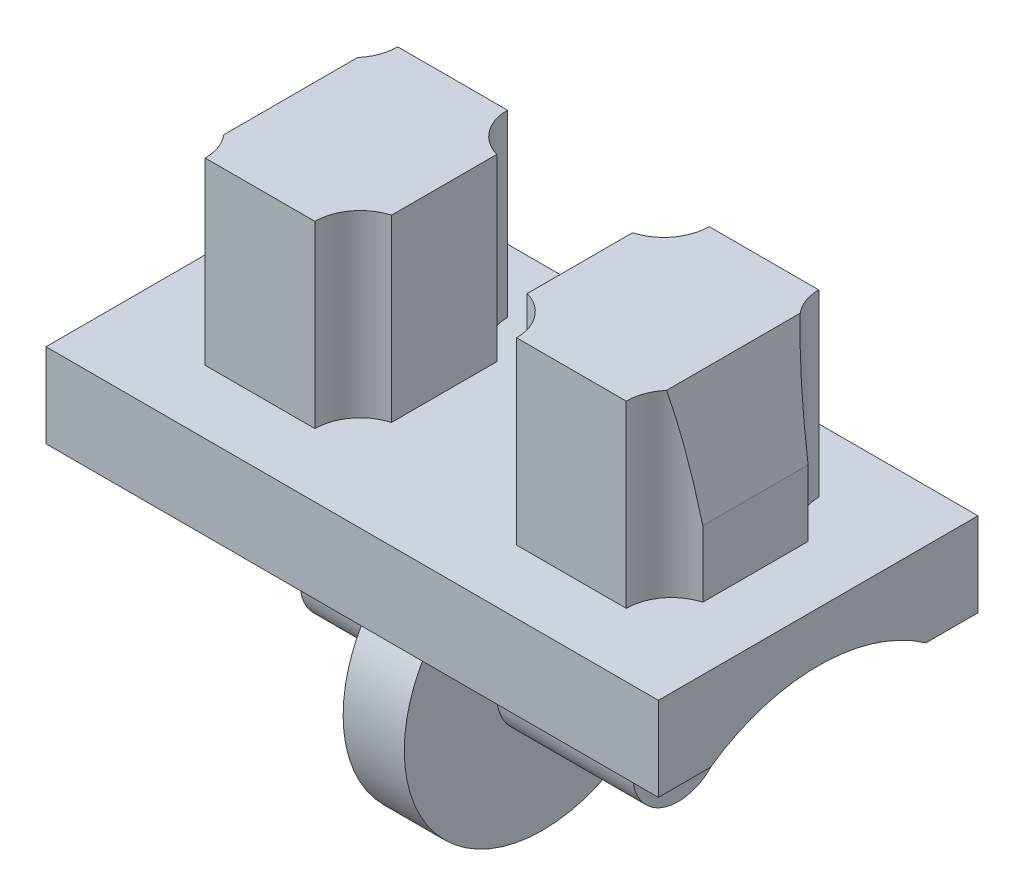
ISO-10303-21;
HEADER;
FILE_DESCRIPTION(('STEP AP214'),'2;1');
FILE_NAME('part.step','',(''),(''),'','','');
FILE_SCHEMA(('AUTOMOTIVE_DESIGN { 1 0 10303 214 1 1 1 1 }'));
ENDSEC;
DATA;
#1=APPLICATION_CONTEXT('core data for automotive mechanical design processes');
#2=APPLICATION_PROTOCOL_DEFINITION('international standard','automotive_design',2000,#1);
#3=PRODUCT_CONTEXT('',#1,'mechanical');
#4=PRODUCT('Part','Part','',(#3));
#5=PRODUCT_RELATED_PRODUCT_CATEGORY('part','',(#4));
#6=PRODUCT_DEFINITION_FORMATION('','',#4);
#7=PRODUCT_DEFINITION_CONTEXT('part definition',#1,'design');
#8=PRODUCT_DEFINITION('design','',#6,#7);
#9=PRODUCT_DEFINITION_SHAPE('','',#8);
#10=(LENGTH_UNIT() NAMED_UNIT(*) SI_UNIT(.MILLI.,.METRE.));
#11=(NAMED_UNIT(*) PLANE_ANGLE_UNIT() SI_UNIT($,.RADIAN.));
#12=(NAMED_UNIT(*) SI_UNIT($,.STERADIAN.) SOLID_ANGLE_UNIT());
#13=UNCERTAINTY_MEASURE_WITH_UNIT(LENGTH_MEASURE(1.E-05),#10,'distance_accuracy_value','');
#14=(GEOMETRIC_REPRESENTATION_CONTEXT(3) GLOBAL_UNCERTAINTY_ASSIGNED_CONTEXT((#13)) GLOBAL_UNIT_ASSIGNED_CONTEXT((#10,
#11,#12)) REPRESENTATION_CONTEXT('',''));
#15=CARTESIAN_POINT('',(0.,0.,0.));
#16=DIRECTION('',(0.,0.,1.));
#17=DIRECTION('',(1.,0.,0.));
#18=AXIS2_PLACEMENT_3D('',#15,#16,#17);
#19=CARTESIAN_POINT('',(4.215,0.,0.));
#20=DIRECTION('',(-1.,0.,0.));
#21=DIRECTION('',(0.,0.,1.));
#22=AXIS2_PLACEMENT_3D('',#19,#20,#21);
#23=CYLINDRICAL_SURFACE('',#22,1.155);
#24=CARTESIAN_POINT('',(0.775,0.,0.));
#25=DIRECTION('',(1.,0.,0.));
#26=DIRECTION('',(0.,0.,-1.));
#27=AXIS2_PLACEMENT_3D('',#24,#25,#26);
#28=CIRCLE('',#27,1.155);
#29=CARTESIAN_POINT('',(0.775,0.,-1.155));
#30=VERTEX_POINT('',#29);
#31=EDGE_CURVE('E447',#30,#30,#28,.T.);
#32=ORIENTED_EDGE('',*,*,#31,.T.);
#33=EDGE_LOOP('',(#32));
#34=FACE_BOUND('',#33,.T.);
#35=CARTESIAN_POINT('',(4.215,0.,0.));
#36=DIRECTION('',(1.,0.,0.));
#37=DIRECTION('',(0.,0.,-1.));
#38=AXIS2_PLACEMENT_3D('',#35,#36,#37);
#39=CIRCLE('',#38,1.155);
#40=CARTESIAN_POINT('',(4.215,0.,-1.155));
#41=VERTEX_POINT('',#40);
#42=EDGE_CURVE('E458',#41,#41,#39,.T.);
#43=ORIENTED_EDGE('',*,*,#42,.F.);
#44=EDGE_LOOP('',(#43));
#45=FACE_BOUND('',#44,.T.);
#46=ADVANCED_FACE('F43',(#34,#45),#23,.T.);
#47=CARTESIAN_POINT('',(4.215,0.,0.));
#48=DIRECTION('',(1.,0.,0.));
#49=DIRECTION('',(0.,0.,-1.));
#50=AXIS2_PLACEMENT_3D('',#47,#48,#49);
#51=PLANE('',#50);
#52=ORIENTED_EDGE('',*,*,#42,.T.);
#53=EDGE_LOOP('',(#52));
#54=FACE_BOUND('',#53,.T.);
#55=ADVANCED_FACE('F505',(#54),#51,.T.);
#56=CARTESIAN_POINT('',(0.775,0.,-2.73));
#57=DIRECTION('',(0.,0.,-1.));
#58=DIRECTION('',(0.,1.,0.));
#59=AXIS2_PLACEMENT_3D('',#56,#57,#58);
#60=PLANE('',#59);
#61=DIRECTION('',(-1.,0.,0.));
#62=VECTOR('',#61,1.);
#63=CARTESIAN_POINT('',(0.775,2.19820949866022,-2.73));
#64=LINE('',#63,#62);
#65=CARTESIAN_POINT('',(0.775,2.19820949866022,-2.73));
#66=VERTEX_POINT('',#65);
#67=CARTESIAN_POINT('',(-0.775,2.19820949866022,-2.73));
#68=VERTEX_POINT('',#67);
#69=EDGE_CURVE('E450',#66,#68,#64,.T.);
#70=ORIENTED_EDGE('',*,*,#69,.T.);
#71=DIRECTION('',(0.,-1.,0.));
#72=VECTOR('',#71,1.);
#73=CARTESIAN_POINT('',(-0.775,0.,-2.73));
#74=LINE('',#73,#72);
#75=CARTESIAN_POINT('',(-0.775,2.73710689330767,-2.73));
#76=VERTEX_POINT('',#75);
#77=EDGE_CURVE('E320',#76,#68,#74,.T.);
#78=ORIENTED_EDGE('',*,*,#77,.F.);
#79=DIRECTION('',(-1.,0.,0.));
#80=VECTOR('',#79,1.);
#81=CARTESIAN_POINT('',(0.775,2.73710689330767,-2.73));
#82=LINE('',#81,#80);
#83=CARTESIAN_POINT('',(0.775,2.73710689330767,-2.73));
#84=VERTEX_POINT('',#83);
#85=EDGE_CURVE('E456',#84,#76,#82,.T.);
#86=ORIENTED_EDGE('',*,*,#85,.F.);
#87=DIRECTION('',(0.,-1.,0.));
#88=VECTOR('',#87,1.);
#89=CARTESIAN_POINT('',(0.775,0.,-2.73));
#90=LINE('',#89,#88);
#91=EDGE_CURVE('E438',#84,#66,#90,.T.);
#92=ORIENTED_EDGE('',*,*,#91,.T.);
#93=EDGE_LOOP('',(#70,#78,#86,#92));
#94=FACE_BOUND('',#93,.T.);
#95=ADVANCED_FACE('F510',(#94),#60,.T.);
#96=CARTESIAN_POINT('',(0.775,0.,2.73));
#97=DIRECTION('',(0.,0.,-1.));
#98=DIRECTION('',(0.,1.,0.));
#99=AXIS2_PLACEMENT_3D('',#96,#97,#98);
#100=PLANE('',#99);
#101=DIRECTION('',(-1.,0.,0.));
#102=VECTOR('',#101,1.);
#103=CARTESIAN_POINT('',(0.775,2.73710689330767,2.73));
#104=LINE('',#103,#102);
#105=CARTESIAN_POINT('',(0.775,2.73710689330767,2.73));
#106=VERTEX_POINT('',#105);
#107=CARTESIAN_POINT('',(-0.775,2.73710689330767,2.73));
#108=VERTEX_POINT('',#107);
#109=EDGE_CURVE('E454',#106,#108,#104,.T.);
#110=ORIENTED_EDGE('',*,*,#109,.T.);
#111=DIRECTION('',(0.,-1.,0.));
#112=VECTOR('',#111,1.);
#113=CARTESIAN_POINT('',(-0.775,0.,2.73));
#114=LINE('',#113,#112);
#115=CARTESIAN_POINT('',(-0.775,2.19820949866022,2.73));
#116=VERTEX_POINT('',#115);
#117=EDGE_CURVE('E326',#108,#116,#114,.T.);
#118=ORIENTED_EDGE('',*,*,#117,.T.);
#119=DIRECTION('',(-1.,0.,0.));
#120=VECTOR('',#119,1.);
#121=CARTESIAN_POINT('',(0.775,2.19820949866022,2.73));
#122=LINE('',#121,#120);
#123=CARTESIAN_POINT('',(0.775,2.19820949866022,2.73));
#124=VERTEX_POINT('',#123);
#125=EDGE_CURVE('E452',#124,#116,#122,.T.);
#126=ORIENTED_EDGE('',*,*,#125,.F.);
#127=DIRECTION('',(0.,-1.,0.));
#128=VECTOR('',#127,1.);
#129=CARTESIAN_POINT('',(0.775,0.,2.73));
#130=LINE('',#129,#128);
#131=EDGE_CURVE('E443',#106,#124,#130,.T.);
#132=ORIENTED_EDGE('',*,*,#131,.F.);
#133=EDGE_LOOP('',(#110,#118,#126,#132));
#134=FACE_BOUND('',#133,.T.);
#135=ADVANCED_FACE('F517',(#134),#100,.F.);
#136=CARTESIAN_POINT('',(0.775,0.,0.));
#137=DIRECTION('',(-1.,0.,0.));
#138=DIRECTION('',(0.,0.,1.));
#139=AXIS2_PLACEMENT_3D('',#136,#137,#138);
#140=CYLINDRICAL_SURFACE('',#139,3.505);
#141=ORIENTED_EDGE('',*,*,#125,.T.);
#142=CARTESIAN_POINT('',(-0.775,0.,0.));
#143=DIRECTION('',(1.,0.,0.));
#144=DIRECTION('',(0.,0.,-1.));
#145=AXIS2_PLACEMENT_3D('',#142,#143,#144);
#146=CIRCLE('',#145,3.505);
#147=EDGE_CURVE('E329',#116,#68,#146,.T.);
#148=ORIENTED_EDGE('',*,*,#147,.T.);
#149=ORIENTED_EDGE('',*,*,#69,.F.);
#150=CARTESIAN_POINT('',(0.775,0.,0.));
#151=DIRECTION('',(1.,0.,0.));
#152=DIRECTION('',(0.,0.,-1.));
#153=AXIS2_PLACEMENT_3D('',#150,#151,#152);
#154=CIRCLE('',#153,3.505);
#155=EDGE_CURVE('E445',#124,#66,#154,.T.);
#156=ORIENTED_EDGE('',*,*,#155,.F.);
#157=EDGE_LOOP('',(#141,#148,#149,#156));
#158=FACE_BOUND('',#157,.T.);
#159=ADVANCED_FACE('F521',(#158),#140,.T.);
#160=CARTESIAN_POINT('',(0.775,0.,0.));
#161=DIRECTION('',(1.,0.,0.));
#162=DIRECTION('',(0.,0.,-1.));
#163=AXIS2_PLACEMENT_3D('',#160,#161,#162);
#164=PLANE('',#163);
#165=ORIENTED_EDGE('',*,*,#91,.F.);
#166=CARTESIAN_POINT('',(0.775,-1.15,0.));
#167=DIRECTION('',(1.,0.,0.));
#168=DIRECTION('',(0.,0.,-1.));
#169=AXIS2_PLACEMENT_3D('',#166,#167,#168);
#170=CIRCLE('',#169,4.75);
#171=EDGE_CURVE('E441',#106,#84,#170,.F.);
#172=ORIENTED_EDGE('',*,*,#171,.F.);
#173=ORIENTED_EDGE('',*,*,#131,.T.);
#174=ORIENTED_EDGE('',*,*,#155,.T.);
#175=EDGE_LOOP('',(#165,#172,#173,#174));
#176=FACE_BOUND('',#175,.T.);
#177=ORIENTED_EDGE('',*,*,#31,.F.);
#178=EDGE_LOOP('',(#177));
#179=FACE_BOUND('',#178,.T.);
#180=ADVANCED_FACE('F525',(#176,#179),#164,.T.);
#181=CARTESIAN_POINT('',(7.76,-1.15,0.));
#182=DIRECTION('',(-1.,0.,0.));
#183=DIRECTION('',(0.,0.,1.));
#184=AXIS2_PLACEMENT_3D('',#181,#182,#183);
#185=CYLINDRICAL_SURFACE('',#184,4.75);
#186=ORIENTED_EDGE('',*,*,#171,.T.);
#187=DIRECTION('',(-1.,0.,0.));
#188=VECTOR('',#187,1.);
#189=CARTESIAN_POINT('',(7.76,2.73710689330767,-2.73));
#190=LINE('',#189,#188);
#191=CARTESIAN_POINT('',(7.76,2.73710689330767,-2.73));
#192=VERTEX_POINT('',#191);
#193=EDGE_CURVE('E435',#192,#84,#190,.T.);
#194=ORIENTED_EDGE('',*,*,#193,.F.);
#195=CARTESIAN_POINT('',(7.76,-1.15,0.));
#196=DIRECTION('',(1.,0.,0.));
#197=DIRECTION('',(0.,0.,-1.));
#198=AXIS2_PLACEMENT_3D('',#195,#196,#197);
#199=CIRCLE('',#198,4.75);
#200=CARTESIAN_POINT('',(7.76,2.73710689330767,2.73));
#201=VERTEX_POINT('',#200);
#202=EDGE_CURVE('E409',#201,#192,#199,.F.);
#203=ORIENTED_EDGE('',*,*,#202,.F.);
#204=DIRECTION('',(-1.,0.,0.));
#205=VECTOR('',#204,1.);
#206=CARTESIAN_POINT('',(7.76,2.73710689330767,2.73));
#207=LINE('',#206,#205);
#208=EDGE_CURVE('E424',#201,#106,#207,.T.);
#209=ORIENTED_EDGE('',*,*,#208,.T.);
#210=EDGE_LOOP('',(#186,#194,#203,#209));
#211=FACE_BOUND('',#210,.T.);
#212=ADVANCED_FACE('F529',(#211),#185,.F.);
#213=CARTESIAN_POINT('',(7.76,2.73710689330767,0.));
#214=DIRECTION('',(0.,1.,0.));
#215=DIRECTION('',(0.,0.,1.));
#216=AXIS2_PLACEMENT_3D('',#213,#214,#215);
#217=PLANE('',#216);
#218=ORIENTED_EDGE('',*,*,#85,.T.);
#219=DIRECTION('',(1.,0.,0.));
#220=VECTOR('',#219,1.);
#221=CARTESIAN_POINT('',(-7.76,2.73710689330767,-2.73));
#222=LINE('',#221,#220);
#223=CARTESIAN_POINT('',(-7.76,2.73710689330767,-2.73));
#224=VERTEX_POINT('',#223);
#225=EDGE_CURVE('E317',#224,#76,#222,.T.);
#226=ORIENTED_EDGE('',*,*,#225,.F.);
#227=DIRECTION('',(0.,0.,-1.));
#228=VECTOR('',#227,1.);
#229=CARTESIAN_POINT('',(-7.76,2.73710689330767,0.));
#230=LINE('',#229,#228);
#231=CARTESIAN_POINT('',(-7.76,2.73710689330767,-4.05));
#232=VERTEX_POINT('',#231);
#233=EDGE_CURVE('E300',#224,#232,#230,.T.);
#234=ORIENTED_EDGE('',*,*,#233,.T.);
#235=DIRECTION('',(-1.,0.,0.));
#236=VECTOR('',#235,1.);
#237=CARTESIAN_POINT('',(7.76,2.73710689330767,-4.05));
#238=LINE('',#237,#236);
#239=CARTESIAN_POINT('',(7.76,2.73710689330767,-4.05));
#240=VERTEX_POINT('',#239);
#241=EDGE_CURVE('E433',#240,#232,#238,.T.);
#242=ORIENTED_EDGE('',*,*,#241,.F.);
#243=DIRECTION('',(0.,0.,-1.));
#244=VECTOR('',#243,1.);
#245=CARTESIAN_POINT('',(7.76,2.73710689330767,0.));
#246=LINE('',#245,#244);
#247=EDGE_CURVE('E412',#192,#240,#246,.T.);
#248=ORIENTED_EDGE('',*,*,#247,.F.);
#249=ORIENTED_EDGE('',*,*,#193,.T.);
#250=EDGE_LOOP('',(#218,#226,#234,#242,#248,#249));
#251=FACE_BOUND('',#250,.T.);
#252=ADVANCED_FACE('F533',(#251),#217,.F.);
#253=CARTESIAN_POINT('',(7.76,0.,-4.05));
#254=DIRECTION('',(0.,0.,1.));
#255=DIRECTION('',(1.,0.,0.));
#256=AXIS2_PLACEMENT_3D('',#253,#254,#255);
#257=PLANE('',#256);
#258=ORIENTED_EDGE('',*,*,#241,.T.);
#259=DIRECTION('',(0.,1.,0.));
#260=VECTOR('',#259,1.);
#261=CARTESIAN_POINT('',(-7.76,0.,-4.05));
#262=LINE('',#261,#260);
#263=CARTESIAN_POINT('',(-7.76,4.86710689330767,-4.05));
#264=VERTEX_POINT('',#263);
#265=EDGE_CURVE('E303',#232,#264,#262,.T.);
#266=ORIENTED_EDGE('',*,*,#265,.T.);
#267=DIRECTION('',(-1.,0.,0.));
#268=VECTOR('',#267,1.);
#269=CARTESIAN_POINT('',(7.76,4.86710689330767,-4.05));
#270=LINE('',#269,#268);
#271=CARTESIAN_POINT('',(7.76,4.86710689330767,-4.05));
#272=VERTEX_POINT('',#271);
#273=EDGE_CURVE('E431',#272,#264,#270,.T.);
#274=ORIENTED_EDGE('',*,*,#273,.F.);
#275=DIRECTION('',(0.,1.,0.));
#276=VECTOR('',#275,1.);
#277=CARTESIAN_POINT('',(7.76,0.,-4.05));
#278=LINE('',#277,#276);
#279=EDGE_CURVE('E414',#240,#272,#278,.T.);
#280=ORIENTED_EDGE('',*,*,#279,.F.);
#281=EDGE_LOOP('',(#258,#266,#274,#280));
#282=FACE_BOUND('',#281,.T.);
#283=ADVANCED_FACE('F537',(#282),#257,.F.);
#284=CARTESIAN_POINT('',(7.76,4.86710689330767,0.));
#285=DIRECTION('',(0.,1.,0.));
#286=DIRECTION('',(0.,0.,1.));
#287=AXIS2_PLACEMENT_3D('',#284,#285,#286);
#288=PLANE('',#287);
#289=CARTESIAN_POINT('',(1.405,4.86710689330767,-2.44));
#290=DIRECTION('',(0.,-1.,0.));
#291=DIRECTION('',(0.,0.,1.));
#292=AXIS2_PLACEMENT_3D('',#289,#290,#291);
#293=CIRCLE('',#292,1.15);
#294=CARTESIAN_POINT('',(2.555,4.86710689330767,-2.44));
#295=VERTEX_POINT('',#294);
#296=CARTESIAN_POINT('',(1.72,4.86710689330767,-1.33398236903746));
#297=VERTEX_POINT('',#296);
#298=EDGE_CURVE('E347',#295,#297,#293,.T.);
#299=ORIENTED_EDGE('',*,*,#298,.F.);
#300=DIRECTION('',(-1.,0.,0.));
#301=VECTOR('',#300,1.);
#302=CARTESIAN_POINT('',(2.555,4.86710689330767,-2.44));
#303=LINE('',#302,#301);
#304=CARTESIAN_POINT('',(5.335,4.86710689330767,-2.44));
#305=VERTEX_POINT('',#304);
#306=EDGE_CURVE('E352',#305,#295,#303,.T.);
#307=ORIENTED_EDGE('',*,*,#306,.F.);
#308=CARTESIAN_POINT('',(6.485,4.86710689330767,-2.44));
#309=DIRECTION('',(0.,-1.,0.));
#310=DIRECTION('',(0.,0.,-1.));
#311=AXIS2_PLACEMENT_3D('',#308,#309,#310);
#312=CIRCLE('',#311,1.15);
#313=CARTESIAN_POINT('',(6.17,4.86710689330767,-1.33398236903746));
#314=VERTEX_POINT('',#313);
#315=EDGE_CURVE('E383',#314,#305,#312,.T.);
#316=ORIENTED_EDGE('',*,*,#315,.F.);
#317=DIRECTION('',(0.,0.,-1.));
#318=VECTOR('',#317,1.);
#319=CARTESIAN_POINT('',(6.17,4.86710689330767,-1.33398236903746));
#320=LINE('',#319,#318);
#321=CARTESIAN_POINT('',(6.17,4.86710689330767,1.33398236903746));
#322=VERTEX_POINT('',#321);
#323=EDGE_CURVE('E380',#322,#314,#320,.T.);
#324=ORIENTED_EDGE('',*,*,#323,.F.);
#325=CARTESIAN_POINT('',(6.485,4.86710689330767,2.44));
#326=DIRECTION('',(0.,-1.,0.));
#327=DIRECTION('',(0.,0.,1.));
#328=AXIS2_PLACEMENT_3D('',#325,#326,#327);
#329=CIRCLE('',#328,1.15);
#330=CARTESIAN_POINT('',(5.335,4.86710689330767,2.44));
#331=VERTEX_POINT('',#330);
#332=EDGE_CURVE('E377',#331,#322,#329,.T.);
#333=ORIENTED_EDGE('',*,*,#332,.F.);
#334=DIRECTION('',(1.,0.,0.));
#335=VECTOR('',#334,1.);
#336=CARTESIAN_POINT('',(2.555,4.86710689330767,2.44));
#337=LINE('',#336,#335);
#338=CARTESIAN_POINT('',(2.555,4.86710689330767,2.44));
#339=VERTEX_POINT('',#338);
#340=EDGE_CURVE('E374',#339,#331,#337,.T.);
#341=ORIENTED_EDGE('',*,*,#340,.F.);
#342=CARTESIAN_POINT('',(1.405,4.86710689330767,2.44));
#343=DIRECTION('',(0.,-1.,0.));
#344=DIRECTION('',(0.,0.,-1.));
#345=AXIS2_PLACEMENT_3D('',#342,#343,#344);
#346=CIRCLE('',#345,1.15);
#347=CARTESIAN_POINT('',(1.72,4.86710689330767,1.33398236903746));
#348=VERTEX_POINT('',#347);
#349=EDGE_CURVE('E371',#348,#339,#346,.T.);
#350=ORIENTED_EDGE('',*,*,#349,.F.);
#351=DIRECTION('',(0.,0.,1.));
#352=VECTOR('',#351,1.);
#353=CARTESIAN_POINT('',(1.72,4.86710689330767,1.33398236903746));
#354=LINE('',#353,#352);
#355=EDGE_CURVE('E368',#297,#348,#354,.T.);
#356=ORIENTED_EDGE('',*,*,#355,.F.);
#357=EDGE_LOOP('',(#299,#307,#316,#324,#333,#341,#350,#356));
#358=FACE_BOUND('',#357,.T.);
#359=ORIENTED_EDGE('',*,*,#273,.T.);
#360=DIRECTION('',(0.,0.,-1.));
#361=VECTOR('',#360,1.);
#362=CARTESIAN_POINT('',(-7.76,4.86710689330767,0.));
#363=LINE('',#362,#361);
#364=CARTESIAN_POINT('',(-7.76,4.86710689330767,4.05));
#365=VERTEX_POINT('',#364);
#366=EDGE_CURVE('E306',#365,#264,#363,.T.);
#367=ORIENTED_EDGE('',*,*,#366,.F.);
#368=DIRECTION('',(-1.,0.,0.));
#369=VECTOR('',#368,1.);
#370=CARTESIAN_POINT('',(7.76,4.86710689330767,4.05));
#371=LINE('',#370,#369);
#372=CARTESIAN_POINT('',(7.76,4.86710689330767,4.05));
#373=VERTEX_POINT('',#372);
#374=EDGE_CURVE('E429',#373,#365,#371,.T.);
#375=ORIENTED_EDGE('',*,*,#374,.F.);
#376=DIRECTION('',(0.,0.,-1.));
#377=VECTOR('',#376,1.);
#378=CARTESIAN_POINT('',(7.76,4.86710689330767,0.));
#379=LINE('',#378,#377);
#380=EDGE_CURVE('E416',#373,#272,#379,.T.);
#381=ORIENTED_EDGE('',*,*,#380,.T.);
#382=EDGE_LOOP('',(#359,#367,#375,#381));
#383=FACE_BOUND('',#382,.T.);
#384=CARTESIAN_POINT('',(-1.405,4.86710689330767,-2.44));
#385=DIRECTION('',(0.,1.,0.));
#386=DIRECTION('',(0.,0.,1.));
#387=AXIS2_PLACEMENT_3D('',#384,#385,#386);
#388=CIRCLE('',#387,1.15);
#389=CARTESIAN_POINT('',(-2.555,4.86710689330767,-2.44));
#390=VERTEX_POINT('',#389);
#391=CARTESIAN_POINT('',(-1.72,4.86710689330767,-1.33398236903746));
#392=VERTEX_POINT('',#391);
#393=EDGE_CURVE('E269',#390,#392,#388,.T.);
#394=ORIENTED_EDGE('',*,*,#393,.T.);
#395=DIRECTION('',(0.,0.,1.));
#396=VECTOR('',#395,1.);
#397=CARTESIAN_POINT('',(-1.72,4.86710689330767,1.33398236903746));
#398=LINE('',#397,#396);
#399=CARTESIAN_POINT('',(-1.72,4.86710689330767,1.33398236903746));
#400=VERTEX_POINT('',#399);
#401=EDGE_CURVE('E242',#392,#400,#398,.T.);
#402=ORIENTED_EDGE('',*,*,#401,.T.);
#403=CARTESIAN_POINT('',(-1.405,4.86710689330767,2.44));
#404=DIRECTION('',(0.,1.,0.));
#405=DIRECTION('',(0.,0.,-1.));
#406=AXIS2_PLACEMENT_3D('',#403,#404,#405);
#407=CIRCLE('',#406,1.15);
#408=CARTESIAN_POINT('',(-2.555,4.86710689330767,2.44));
#409=VERTEX_POINT('',#408);
#410=EDGE_CURVE('E272',#400,#409,#407,.T.);
#411=ORIENTED_EDGE('',*,*,#410,.T.);
#412=DIRECTION('',(-1.,0.,0.));
#413=VECTOR('',#412,1.);
#414=CARTESIAN_POINT('',(-2.555,4.86710689330767,2.44));
#415=LINE('',#414,#413);
#416=CARTESIAN_POINT('',(-5.335,4.86710689330767,2.44));
#417=VERTEX_POINT('',#416);
#418=EDGE_CURVE('E275',#409,#417,#415,.T.);
#419=ORIENTED_EDGE('',*,*,#418,.T.);
#420=CARTESIAN_POINT('',(-6.485,4.86710689330767,2.44));
#421=DIRECTION('',(0.,1.,0.));
#422=DIRECTION('',(0.,0.,1.));
#423=AXIS2_PLACEMENT_3D('',#420,#421,#422);
#424=CIRCLE('',#423,1.15);
#425=CARTESIAN_POINT('',(-6.17,4.86710689330767,1.33398236903746));
#426=VERTEX_POINT('',#425);
#427=EDGE_CURVE('E278',#417,#426,#424,.T.);
#428=ORIENTED_EDGE('',*,*,#427,.T.);
#429=DIRECTION('',(0.,0.,-1.));
#430=VECTOR('',#429,1.);
#431=CARTESIAN_POINT('',(-6.17,4.86710689330767,-1.33398236903746));
#432=LINE('',#431,#430);
#433=CARTESIAN_POINT('',(-6.17,4.86710689330767,-1.33398236903746));
#434=VERTEX_POINT('',#433);
#435=EDGE_CURVE('E281',#426,#434,#432,.T.);
#436=ORIENTED_EDGE('',*,*,#435,.T.);
#437=CARTESIAN_POINT('',(-6.485,4.86710689330767,-2.44));
#438=DIRECTION('',(0.,1.,0.));
#439=DIRECTION('',(0.,0.,-1.));
#440=AXIS2_PLACEMENT_3D('',#437,#438,#439);
#441=CIRCLE('',#440,1.15);
#442=CARTESIAN_POINT('',(-5.335,4.86710689330767,-2.44));
#443=VERTEX_POINT('',#442);
#444=EDGE_CURVE('E254',#434,#443,#441,.T.);
#445=ORIENTED_EDGE('',*,*,#444,.T.);
#446=DIRECTION('',(1.,0.,0.));
#447=VECTOR('',#446,1.);
#448=CARTESIAN_POINT('',(-2.555,4.86710689330767,-2.44));
#449=LINE('',#448,#447);
#450=EDGE_CURVE('E251',#443,#390,#449,.T.);
#451=ORIENTED_EDGE('',*,*,#450,.T.);
#452=EDGE_LOOP('',(#394,#402,#411,#419,#428,#436,#445,#451));
#453=FACE_BOUND('',#452,.T.);
#454=ADVANCED_FACE('F541',(#358,#383,#453),#288,.T.);
#455=CARTESIAN_POINT('',(7.76,0.,4.05));
#456=DIRECTION('',(0.,0.,1.));
#457=DIRECTION('',(1.,0.,0.));
#458=AXIS2_PLACEMENT_3D('',#455,#456,#457);
#459=PLANE('',#458);
#460=ORIENTED_EDGE('',*,*,#374,.T.);
#461=DIRECTION('',(0.,1.,0.));
#462=VECTOR('',#461,1.);
#463=CARTESIAN_POINT('',(-7.76,0.,4.05));
#464=LINE('',#463,#462);
#465=CARTESIAN_POINT('',(-7.76,2.73710689330767,4.05));
#466=VERTEX_POINT('',#465);
#467=EDGE_CURVE('E309',#466,#365,#464,.T.);
#468=ORIENTED_EDGE('',*,*,#467,.F.);
#469=DIRECTION('',(-1.,0.,0.));
#470=VECTOR('',#469,1.);
#471=CARTESIAN_POINT('',(7.76,2.73710689330767,4.05));
#472=LINE('',#471,#470);
#473=CARTESIAN_POINT('',(7.76,2.73710689330767,4.05));
#474=VERTEX_POINT('',#473);
#475=EDGE_CURVE('E427',#474,#466,#472,.T.);
#476=ORIENTED_EDGE('',*,*,#475,.F.);
#477=DIRECTION('',(0.,1.,0.));
#478=VECTOR('',#477,1.);
#479=CARTESIAN_POINT('',(7.76,0.,4.05));
#480=LINE('',#479,#478);
#481=EDGE_CURVE('E419',#474,#373,#480,.T.);
#482=ORIENTED_EDGE('',*,*,#481,.T.);
#483=EDGE_LOOP('',(#460,#468,#476,#482));
#484=FACE_BOUND('',#483,.T.);
#485=ADVANCED_FACE('F545',(#484),#459,.T.);
#486=CARTESIAN_POINT('',(7.76,2.73710689330767,0.));
#487=DIRECTION('',(0.,1.,0.));
#488=DIRECTION('',(0.,0.,1.));
#489=AXIS2_PLACEMENT_3D('',#486,#487,#488);
#490=PLANE('',#489);
#491=ORIENTED_EDGE('',*,*,#475,.T.);
#492=DIRECTION('',(0.,0.,-1.));
#493=VECTOR('',#492,1.);
#494=CARTESIAN_POINT('',(-7.76,2.73710689330767,0.));
#495=LINE('',#494,#493);
#496=CARTESIAN_POINT('',(-7.76,2.73710689330767,2.73));
#497=VERTEX_POINT('',#496);
#498=EDGE_CURVE('E312',#466,#497,#495,.T.);
#499=ORIENTED_EDGE('',*,*,#498,.T.);
#500=DIRECTION('',(1.,0.,0.));
#501=VECTOR('',#500,1.);
#502=CARTESIAN_POINT('',(-7.76,2.73710689330767,2.73));
#503=LINE('',#502,#501);
#504=EDGE_CURVE('E314',#497,#108,#503,.T.);
#505=ORIENTED_EDGE('',*,*,#504,.T.);
#506=ORIENTED_EDGE('',*,*,#109,.F.);
#507=ORIENTED_EDGE('',*,*,#208,.F.);
#508=DIRECTION('',(0.,0.,-1.));
#509=VECTOR('',#508,1.);
#510=CARTESIAN_POINT('',(7.76,2.73710689330767,0.));
#511=LINE('',#510,#509);
#512=EDGE_CURVE('E422',#474,#201,#511,.T.);
#513=ORIENTED_EDGE('',*,*,#512,.F.);
#514=EDGE_LOOP('',(#491,#499,#505,#506,#507,#513));
#515=FACE_BOUND('',#514,.T.);
#516=ADVANCED_FACE('F549',(#515),#490,.F.);
#517=CARTESIAN_POINT('',(7.76,0.,0.));
#518=DIRECTION('',(1.,0.,0.));
#519=DIRECTION('',(0.,0.,-1.));
#520=AXIS2_PLACEMENT_3D('',#517,#518,#519);
#521=PLANE('',#520);
#522=ORIENTED_EDGE('',*,*,#202,.T.);
#523=ORIENTED_EDGE('',*,*,#247,.T.);
#524=ORIENTED_EDGE('',*,*,#279,.T.);
#525=ORIENTED_EDGE('',*,*,#380,.F.);
#526=ORIENTED_EDGE('',*,*,#481,.F.);
#527=ORIENTED_EDGE('',*,*,#512,.T.);
#528=EDGE_LOOP('',(#522,#523,#524,#525,#526,#527));
#529=FACE_BOUND('',#528,.T.);
#530=ADVANCED_FACE('F553',(#529),#521,.T.);
#531=CARTESIAN_POINT('',(1.405,9.41710689330767,-2.44));
#532=DIRECTION('',(0.,-1.,0.));
#533=DIRECTION('',(0.,0.,-1.));
#534=AXIS2_PLACEMENT_3D('',#531,#532,#533);
#535=CYLINDRICAL_SURFACE('',#534,1.15);
#536=ORIENTED_EDGE('',*,*,#298,.T.);
#537=DIRECTION('',(0.,-1.,0.));
#538=VECTOR('',#537,1.);
#539=CARTESIAN_POINT('',(1.72,9.41710689330767,-1.33398236903746));
#540=LINE('',#539,#538);
#541=CARTESIAN_POINT('',(1.72,9.41710689330767,-1.33398236903746));
#542=VERTEX_POINT('',#541);
#543=EDGE_CURVE('E406',#542,#297,#540,.T.);
#544=ORIENTED_EDGE('',*,*,#543,.F.);
#545=CARTESIAN_POINT('',(1.405,9.41710689330767,-2.44));
#546=DIRECTION('',(0.,-1.,0.));
#547=DIRECTION('',(0.,0.,1.));
#548=AXIS2_PLACEMENT_3D('',#545,#546,#547);
#549=CIRCLE('',#548,1.15);
#550=CARTESIAN_POINT('',(2.555,9.41710689330767,-2.44));
#551=VERTEX_POINT('',#550);
#552=EDGE_CURVE('E348',#551,#542,#549,.T.);
#553=ORIENTED_EDGE('',*,*,#552,.F.);
#554=DIRECTION('',(0.,-1.,0.));
#555=VECTOR('',#554,1.);
#556=CARTESIAN_POINT('',(2.555,9.41710689330767,-2.44));
#557=LINE('',#556,#555);
#558=EDGE_CURVE('E365',#551,#295,#557,.T.);
#559=ORIENTED_EDGE('',*,*,#558,.T.);
#560=EDGE_LOOP('',(#536,#544,#553,#559));
#561=FACE_BOUND('',#560,.T.);
#562=ADVANCED_FACE('F481',(#561),#535,.F.);
#563=CARTESIAN_POINT('',(1.72,9.41710689330767,1.33398236903746));
#564=DIRECTION('',(1.,0.,0.));
#565=DIRECTION('',(0.,0.,-1.));
#566=AXIS2_PLACEMENT_3D('',#563,#564,#565);
#567=PLANE('',#566);
#568=ORIENTED_EDGE('',*,*,#355,.T.);
#569=DIRECTION('',(0.,-1.,0.));
#570=VECTOR('',#569,1.);
#571=CARTESIAN_POINT('',(1.72,9.41710689330767,1.33398236903746));
#572=LINE('',#571,#570);
#573=CARTESIAN_POINT('',(1.72,9.41710689330767,1.33398236903746));
#574=VERTEX_POINT('',#573);
#575=EDGE_CURVE('E403',#574,#348,#572,.T.);
#576=ORIENTED_EDGE('',*,*,#575,.F.);
#577=DIRECTION('',(0.,0.,1.));
#578=VECTOR('',#577,1.);
#579=CARTESIAN_POINT('',(1.72,9.41710689330767,1.33398236903746));
#580=LINE('',#579,#578);
#581=EDGE_CURVE('E351',#542,#574,#580,.T.);
#582=ORIENTED_EDGE('',*,*,#581,.F.);
#583=ORIENTED_EDGE('',*,*,#543,.T.);
#584=EDGE_LOOP('',(#568,#576,#582,#583));
#585=FACE_BOUND('',#584,.T.);
#586=ADVANCED_FACE('F483',(#585),#567,.F.);
#587=CARTESIAN_POINT('',(1.405,9.41710689330767,2.44));
#588=DIRECTION('',(0.,-1.,0.));
#589=DIRECTION('',(0.,0.,-1.));
#590=AXIS2_PLACEMENT_3D('',#587,#588,#589);
#591=CYLINDRICAL_SURFACE('',#590,1.15);
#592=ORIENTED_EDGE('',*,*,#349,.T.);
#593=DIRECTION('',(0.,-1.,0.));
#594=VECTOR('',#593,1.);
#595=CARTESIAN_POINT('',(2.555,9.41710689330767,2.44));
#596=LINE('',#595,#594);
#597=CARTESIAN_POINT('',(2.555,9.41710689330767,2.44));
#598=VERTEX_POINT('',#597);
#599=EDGE_CURVE('E400',#598,#339,#596,.T.);
#600=ORIENTED_EDGE('',*,*,#599,.F.);
#601=CARTESIAN_POINT('',(1.405,9.41710689330767,2.44));
#602=DIRECTION('',(0.,-1.,0.));
#603=DIRECTION('',(0.,0.,-1.));
#604=AXIS2_PLACEMENT_3D('',#601,#602,#603);
#605=CIRCLE('',#604,1.15);
#606=EDGE_CURVE('E354',#574,#598,#605,.T.);
#607=ORIENTED_EDGE('',*,*,#606,.F.);
#608=ORIENTED_EDGE('',*,*,#575,.T.);
#609=EDGE_LOOP('',(#592,#600,#607,#608));
#610=FACE_BOUND('',#609,.T.);
#611=ADVANCED_FACE('F487',(#610),#591,.F.);
#612=CARTESIAN_POINT('',(2.555,9.41710689330767,2.44));
#613=DIRECTION('',(0.,0.,-1.));
#614=DIRECTION('',(-1.,0.,0.));
#615=AXIS2_PLACEMENT_3D('',#612,#613,#614);
#616=PLANE('',#615);
#617=ORIENTED_EDGE('',*,*,#340,.T.);
#618=DIRECTION('',(0.,-1.,0.));
#619=VECTOR('',#618,1.);
#620=CARTESIAN_POINT('',(5.335,9.41710689330767,2.44));
#621=LINE('',#620,#619);
#622=CARTESIAN_POINT('',(5.335,9.41710689330767,2.44));
#623=VERTEX_POINT('',#622);
#624=EDGE_CURVE('E397',#623,#331,#621,.T.);
#625=ORIENTED_EDGE('',*,*,#624,.F.);
#626=DIRECTION('',(1.,0.,0.));
#627=VECTOR('',#626,1.);
#628=CARTESIAN_POINT('',(2.555,9.41710689330767,2.44));
#629=LINE('',#628,#627);
#630=EDGE_CURVE('E356',#598,#623,#629,.T.);
#631=ORIENTED_EDGE('',*,*,#630,.F.);
#632=ORIENTED_EDGE('',*,*,#599,.T.);
#633=EDGE_LOOP('',(#617,#625,#631,#632));
#634=FACE_BOUND('',#633,.T.);
#635=ADVANCED_FACE('F491',(#634),#616,.F.);
#636=CARTESIAN_POINT('',(6.485,9.41710689330767,2.44));
#637=DIRECTION('',(0.,-1.,0.));
#638=DIRECTION('',(0.,0.,-1.));
#639=AXIS2_PLACEMENT_3D('',#636,#637,#638);
#640=CYLINDRICAL_SURFACE('',#639,1.15);
#641=DIRECTION('',(0.,-1.,0.));
#642=VECTOR('',#641,1.);
#643=CARTESIAN_POINT('',(6.17,9.41710689330767,1.33398236903746));
#644=LINE('',#643,#642);
#645=CARTESIAN_POINT('',(6.17,6.54710689330762,1.33398236903746));
#646=VERTEX_POINT('',#645);
#647=EDGE_CURVE('E395',#646,#322,#644,.T.);
#648=ORIENTED_EDGE('',*,*,#647,.F.);
#649=CARTESIAN_POINT('',(6.485,4.93273189330758,2.44));
#650=DIRECTION('',(0.9814905920257,0.191510359419645,0.));
#651=DIRECTION('',(0.191510359419645,-0.9814905920257,0.));
#652=AXIS2_PLACEMENT_3D('',#649,#650,#651);
#653=ELLIPSE('',#652,6.00489709008417,1.15);
#654=CARTESIAN_POINT('',(5.61,9.41710689330767,1.69375942217004));
#655=VERTEX_POINT('',#654);
#656=EDGE_CURVE('E11',#646,#655,#653,.T.);
#657=ORIENTED_EDGE('',*,*,#656,.T.);
#658=CARTESIAN_POINT('',(6.485,9.41710689330767,2.44));
#659=DIRECTION('',(0.,-1.,0.));
#660=DIRECTION('',(0.,0.,1.));
#661=AXIS2_PLACEMENT_3D('',#658,#659,#660);
#662=CIRCLE('',#661,1.15);
#663=EDGE_CURVE('E358',#623,#655,#662,.T.);
#664=ORIENTED_EDGE('',*,*,#663,.F.);
#665=ORIENTED_EDGE('',*,*,#624,.T.);
#666=ORIENTED_EDGE('',*,*,#332,.T.);
#667=EDGE_LOOP('',(#648,#657,#664,#665,#666));
#668=FACE_BOUND('',#667,.T.);
#669=ADVANCED_FACE('F493',(#668),#640,.F.);
#670=CARTESIAN_POINT('',(6.17,9.41710689330767,-1.33398236903746));
#671=DIRECTION('',(-1.,0.,0.));
#672=DIRECTION('',(0.,0.,1.));
#673=AXIS2_PLACEMENT_3D('',#670,#671,#672);
#674=PLANE('',#673);
#675=DIRECTION('',(0.,-1.,0.));
#676=VECTOR('',#675,1.);
#677=CARTESIAN_POINT('',(6.17,9.41710689330767,-1.33398236903746));
#678=LINE('',#677,#676);
#679=CARTESIAN_POINT('',(6.17,6.54710689330762,-1.33398236903746));
#680=VERTEX_POINT('',#679);
#681=EDGE_CURVE('E393',#680,#314,#678,.T.);
#682=ORIENTED_EDGE('',*,*,#681,.F.);
#683=DIRECTION('',(0.,0.,1.));
#684=VECTOR('',#683,1.);
#685=CARTESIAN_POINT('',(6.17,6.54710689330762,1.33398236903746));
#686=LINE('',#685,#684);
#687=EDGE_CURVE('E52',#680,#646,#686,.T.);
#688=ORIENTED_EDGE('',*,*,#687,.T.);
#689=ORIENTED_EDGE('',*,*,#647,.T.);
#690=ORIENTED_EDGE('',*,*,#323,.T.);
#691=EDGE_LOOP('',(#682,#688,#689,#690));
#692=FACE_BOUND('',#691,.T.);
#693=ADVANCED_FACE('F568',(#692),#674,.F.);
#694=CARTESIAN_POINT('',(6.485,9.41710689330767,-2.44));
#695=DIRECTION('',(0.,-1.,0.));
#696=DIRECTION('',(0.,0.,-1.));
#697=AXIS2_PLACEMENT_3D('',#694,#695,#696);
#698=CYLINDRICAL_SURFACE('',#697,1.15);
#699=CARTESIAN_POINT('',(6.485,9.41710689330767,-2.44));
#700=DIRECTION('',(0.,-1.,0.));
#701=DIRECTION('',(0.,0.,-1.));
#702=AXIS2_PLACEMENT_3D('',#699,#700,#701);
#703=CIRCLE('',#702,1.15);
#704=CARTESIAN_POINT('',(5.61,9.41710689330767,-1.69375942217004));
#705=VERTEX_POINT('',#704);
#706=CARTESIAN_POINT('',(5.335,9.41710689330767,-2.44));
#707=VERTEX_POINT('',#706);
#708=EDGE_CURVE('E361',#705,#707,#703,.T.);
#709=ORIENTED_EDGE('',*,*,#708,.F.);
#710=CARTESIAN_POINT('',(6.485,4.93273189330758,-2.44));
#711=DIRECTION('',(0.9814905920257,0.191510359419645,0.));
#712=DIRECTION('',(0.191510359419645,-0.9814905920257,0.));
#713=AXIS2_PLACEMENT_3D('',#710,#711,#712);
#714=ELLIPSE('',#713,6.00489709008417,1.15);
#715=EDGE_CURVE('E66',#705,#680,#714,.T.);
#716=ORIENTED_EDGE('',*,*,#715,.T.);
#717=ORIENTED_EDGE('',*,*,#681,.T.);
#718=ORIENTED_EDGE('',*,*,#315,.T.);
#719=DIRECTION('',(0.,-1.,0.));
#720=VECTOR('',#719,1.);
#721=CARTESIAN_POINT('',(5.335,9.41710689330767,-2.44));
#722=LINE('',#721,#720);
#723=EDGE_CURVE('E390',#707,#305,#722,.T.);
#724=ORIENTED_EDGE('',*,*,#723,.F.);
#725=EDGE_LOOP('',(#709,#716,#717,#718,#724));
#726=FACE_BOUND('',#725,.T.);
#727=ADVANCED_FACE('F471',(#726),#698,.F.);
#728=CARTESIAN_POINT('',(2.555,9.41710689330767,-2.44));
#729=DIRECTION('',(0.,0.,1.));
#730=DIRECTION('',(1.,0.,0.));
#731=AXIS2_PLACEMENT_3D('',#728,#729,#730);
#732=PLANE('',#731);
#733=ORIENTED_EDGE('',*,*,#306,.T.);
#734=ORIENTED_EDGE('',*,*,#558,.F.);
#735=DIRECTION('',(-1.,0.,0.));
#736=VECTOR('',#735,1.);
#737=CARTESIAN_POINT('',(2.555,9.41710689330767,-2.44));
#738=LINE('',#737,#736);
#739=EDGE_CURVE('E363',#707,#551,#738,.T.);
#740=ORIENTED_EDGE('',*,*,#739,.F.);
#741=ORIENTED_EDGE('',*,*,#723,.T.);
#742=EDGE_LOOP('',(#733,#734,#740,#741));
#743=FACE_BOUND('',#742,.T.);
#744=ADVANCED_FACE('F476',(#743),#732,.F.);
#745=CARTESIAN_POINT('',(1.405,9.41710689330767,-2.44));
#746=DIRECTION('',(0.,1.,0.));
#747=DIRECTION('',(0.,0.,1.));
#748=AXIS2_PLACEMENT_3D('',#745,#746,#747);
#749=PLANE('',#748);
#750=ORIENTED_EDGE('',*,*,#663,.T.);
#751=DIRECTION('',(0.,0.,-1.));
#752=VECTOR('',#751,1.);
#753=CARTESIAN_POINT('',(5.61,9.41710689330767,-1.33398236903746));
#754=LINE('',#753,#752);
#755=EDGE_CURVE('E461',#655,#705,#754,.T.);
#756=ORIENTED_EDGE('',*,*,#755,.T.);
#757=ORIENTED_EDGE('',*,*,#708,.T.);
#758=ORIENTED_EDGE('',*,*,#739,.T.);
#759=ORIENTED_EDGE('',*,*,#552,.T.);
#760=ORIENTED_EDGE('',*,*,#581,.T.);
#761=ORIENTED_EDGE('',*,*,#606,.T.);
#762=ORIENTED_EDGE('',*,*,#630,.T.);
#763=EDGE_LOOP('',(#750,#756,#757,#758,#759,#760,#761,#762));
#764=FACE_BOUND('',#763,.T.);
#765=ADVANCED_FACE('F466',(#764),#749,.T.);
#766=CARTESIAN_POINT('',(5.61,9.41710689330767,-2.44));
#767=DIRECTION('',(0.9814905920257,0.191510359419645,0.));
#768=DIRECTION('',(0.,0.,1.));
#769=AXIS2_PLACEMENT_3D('',#766,#767,#768);
#770=PLANE('',#769);
#771=ORIENTED_EDGE('',*,*,#656,.F.);
#772=ORIENTED_EDGE('',*,*,#687,.F.);
#773=ORIENTED_EDGE('',*,*,#715,.F.);
#774=ORIENTED_EDGE('',*,*,#755,.F.);
#775=EDGE_LOOP('',(#771,#772,#773,#774));
#776=FACE_BOUND('',#775,.T.);
#777=ADVANCED_FACE('F46',(#776),#770,.T.);
#778=CARTESIAN_POINT('',(-4.215,0.,0.));
#779=DIRECTION('',(1.,0.,0.));
#780=DIRECTION('',(0.,0.,1.));
#781=AXIS2_PLACEMENT_3D('',#778,#779,#780);
#782=CYLINDRICAL_SURFACE('',#781,1.155);
#783=CARTESIAN_POINT('',(-0.775,0.,0.));
#784=DIRECTION('',(1.,0.,0.));
#785=DIRECTION('',(0.,0.,-1.));
#786=AXIS2_PLACEMENT_3D('',#783,#784,#785);
#787=CIRCLE('',#786,1.155);
#788=CARTESIAN_POINT('',(-0.775,0.,-1.155));
#789=VERTEX_POINT('',#788);
#790=EDGE_CURVE('E332',#789,#789,#787,.T.);
#791=ORIENTED_EDGE('',*,*,#790,.F.);
#792=EDGE_LOOP('',(#791));
#793=FACE_BOUND('',#792,.T.);
#794=CARTESIAN_POINT('',(-4.215,0.,0.));
#795=DIRECTION('',(1.,0.,0.));
#796=DIRECTION('',(0.,0.,-1.));
#797=AXIS2_PLACEMENT_3D('',#794,#795,#796);
#798=CIRCLE('',#797,1.155);
#799=CARTESIAN_POINT('',(-4.215,0.,-1.155));
#800=VERTEX_POINT('',#799);
#801=EDGE_CURVE('E335',#800,#800,#798,.T.);
#802=ORIENTED_EDGE('',*,*,#801,.T.);
#803=EDGE_LOOP('',(#802));
#804=FACE_BOUND('',#803,.T.);
#805=ADVANCED_FACE('F495',(#793,#804),#782,.T.);
#806=CARTESIAN_POINT('',(-4.215,0.,0.));
#807=DIRECTION('',(-1.,0.,0.));
#808=DIRECTION('',(0.,0.,-1.));
#809=AXIS2_PLACEMENT_3D('',#806,#807,#808);
#810=PLANE('',#809);
#811=ORIENTED_EDGE('',*,*,#801,.F.);
#812=EDGE_LOOP('',(#811));
#813=FACE_BOUND('',#812,.T.);
#814=ADVANCED_FACE('F500',(#813),#810,.T.);
#815=CARTESIAN_POINT('',(-0.775,0.,0.));
#816=DIRECTION('',(-1.,0.,0.));
#817=DIRECTION('',(0.,0.,-1.));
#818=AXIS2_PLACEMENT_3D('',#815,#816,#817);
#819=PLANE('',#818);
#820=ORIENTED_EDGE('',*,*,#77,.T.);
#821=ORIENTED_EDGE('',*,*,#147,.F.);
#822=ORIENTED_EDGE('',*,*,#117,.F.);
#823=CARTESIAN_POINT('',(-0.775,-1.15,0.));
#824=DIRECTION('',(1.,0.,0.));
#825=DIRECTION('',(0.,0.,-1.));
#826=AXIS2_PLACEMENT_3D('',#823,#824,#825);
#827=CIRCLE('',#826,4.75);
#828=EDGE_CURVE('E323',#108,#76,#827,.F.);
#829=ORIENTED_EDGE('',*,*,#828,.T.);
#830=EDGE_LOOP('',(#820,#821,#822,#829));
#831=FACE_BOUND('',#830,.T.);
#832=ORIENTED_EDGE('',*,*,#790,.T.);
#833=EDGE_LOOP('',(#832));
#834=FACE_BOUND('',#833,.T.);
#835=ADVANCED_FACE('F581',(#831,#834),#819,.T.);
#836=CARTESIAN_POINT('',(-7.76,-1.15,0.));
#837=DIRECTION('',(1.,0.,0.));
#838=DIRECTION('',(0.,0.,1.));
#839=AXIS2_PLACEMENT_3D('',#836,#837,#838);
#840=CYLINDRICAL_SURFACE('',#839,4.75);
#841=ORIENTED_EDGE('',*,*,#828,.F.);
#842=ORIENTED_EDGE('',*,*,#504,.F.);
#843=CARTESIAN_POINT('',(-7.76,-1.15,0.));
#844=DIRECTION('',(1.,0.,0.));
#845=DIRECTION('',(0.,0.,-1.));
#846=AXIS2_PLACEMENT_3D('',#843,#844,#845);
#847=CIRCLE('',#846,4.75);
#848=EDGE_CURVE('E246',#497,#224,#847,.F.);
#849=ORIENTED_EDGE('',*,*,#848,.T.);
#850=ORIENTED_EDGE('',*,*,#225,.T.);
#851=EDGE_LOOP('',(#841,#842,#849,#850));
#852=FACE_BOUND('',#851,.T.);
#853=ADVANCED_FACE('F585',(#852),#840,.F.);
#854=CARTESIAN_POINT('',(-7.76,0.,0.));
#855=DIRECTION('',(-1.,0.,0.));
#856=DIRECTION('',(0.,0.,-1.));
#857=AXIS2_PLACEMENT_3D('',#854,#855,#856);
#858=PLANE('',#857);
#859=ORIENTED_EDGE('',*,*,#848,.F.);
#860=ORIENTED_EDGE('',*,*,#498,.F.);
#861=ORIENTED_EDGE('',*,*,#467,.T.);
#862=ORIENTED_EDGE('',*,*,#366,.T.);
#863=ORIENTED_EDGE('',*,*,#265,.F.);
#864=ORIENTED_EDGE('',*,*,#233,.F.);
#865=EDGE_LOOP('',(#859,#860,#861,#862,#863,#864));
#866=FACE_BOUND('',#865,.T.);
#867=ADVANCED_FACE('F589',(#866),#858,.T.);
#868=CARTESIAN_POINT('',(-1.405,9.41710689330767,-2.44));
#869=DIRECTION('',(0.,-1.,0.));
#870=DIRECTION('',(0.,0.,-1.));
#871=AXIS2_PLACEMENT_3D('',#868,#869,#870);
#872=CYLINDRICAL_SURFACE('',#871,1.15);
#873=ORIENTED_EDGE('',*,*,#393,.F.);
#874=DIRECTION('',(0.,-1.,0.));
#875=VECTOR('',#874,1.);
#876=CARTESIAN_POINT('',(-2.555,9.41710689330767,-2.44));
#877=LINE('',#876,#875);
#878=CARTESIAN_POINT('',(-2.555,9.41710689330767,-2.44));
#879=VERTEX_POINT('',#878);
#880=EDGE_CURVE('E250',#879,#390,#877,.T.);
#881=ORIENTED_EDGE('',*,*,#880,.F.);
#882=CARTESIAN_POINT('',(-1.405,9.41710689330767,-2.44));
#883=DIRECTION('',(0.,1.,0.));
#884=DIRECTION('',(0.,0.,1.));
#885=AXIS2_PLACEMENT_3D('',#882,#883,#884);
#886=CIRCLE('',#885,1.15);
#887=CARTESIAN_POINT('',(-1.72,9.41710689330767,-1.33398236903746));
#888=VERTEX_POINT('',#887);
#889=EDGE_CURVE('E231',#879,#888,#886,.T.);
#890=ORIENTED_EDGE('',*,*,#889,.T.);
#891=DIRECTION('',(0.,-1.,0.));
#892=VECTOR('',#891,1.);
#893=CARTESIAN_POINT('',(-1.72,9.41710689330767,-1.33398236903746));
#894=LINE('',#893,#892);
#895=EDGE_CURVE('E239',#888,#392,#894,.T.);
#896=ORIENTED_EDGE('',*,*,#895,.T.);
#897=EDGE_LOOP('',(#873,#881,#890,#896));
#898=FACE_BOUND('',#897,.T.);
#899=ADVANCED_FACE('F249',(#898),#872,.F.);
#900=CARTESIAN_POINT('',(-1.72,9.41710689330767,1.33398236903746));
#901=DIRECTION('',(-1.,0.,0.));
#902=DIRECTION('',(0.,0.,-1.));
#903=AXIS2_PLACEMENT_3D('',#900,#901,#902);
#904=PLANE('',#903);
#905=ORIENTED_EDGE('',*,*,#401,.F.);
#906=ORIENTED_EDGE('',*,*,#895,.F.);
#907=DIRECTION('',(0.,0.,1.));
#908=VECTOR('',#907,1.);
#909=CARTESIAN_POINT('',(-1.72,9.41710689330767,1.33398236903746));
#910=LINE('',#909,#908);
#911=CARTESIAN_POINT('',(-1.72,9.41710689330767,1.33398236903746));
#912=VERTEX_POINT('',#911);
#913=EDGE_CURVE('E227',#888,#912,#910,.T.);
#914=ORIENTED_EDGE('',*,*,#913,.T.);
#915=DIRECTION('',(0.,-1.,0.));
#916=VECTOR('',#915,1.);
#917=CARTESIAN_POINT('',(-1.72,9.41710689330767,1.33398236903746));
#918=LINE('',#917,#916);
#919=EDGE_CURVE('E247',#912,#400,#918,.T.);
#920=ORIENTED_EDGE('',*,*,#919,.T.);
#921=EDGE_LOOP('',(#905,#906,#914,#920));
#922=FACE_BOUND('',#921,.T.);
#923=ADVANCED_FACE('F240',(#922),#904,.F.);
#924=CARTESIAN_POINT('',(-1.405,9.41710689330767,2.44));
#925=DIRECTION('',(0.,-1.,0.));
#926=DIRECTION('',(0.,0.,-1.));
#927=AXIS2_PLACEMENT_3D('',#924,#925,#926);
#928=CYLINDRICAL_SURFACE('',#927,1.15);
#929=ORIENTED_EDGE('',*,*,#410,.F.);
#930=ORIENTED_EDGE('',*,*,#919,.F.);
#931=CARTESIAN_POINT('',(-1.405,9.41710689330767,2.44));
#932=DIRECTION('',(0.,1.,0.));
#933=DIRECTION('',(0.,0.,-1.));
#934=AXIS2_PLACEMENT_3D('',#931,#932,#933);
#935=CIRCLE('',#934,1.15);
#936=CARTESIAN_POINT('',(-2.555,9.41710689330767,2.44));
#937=VERTEX_POINT('',#936);
#938=EDGE_CURVE('E234',#912,#937,#935,.T.);
#939=ORIENTED_EDGE('',*,*,#938,.T.);
#940=DIRECTION('',(0.,-1.,0.));
#941=VECTOR('',#940,1.);
#942=CARTESIAN_POINT('',(-2.555,9.41710689330767,2.44));
#943=LINE('',#942,#941);
#944=EDGE_CURVE('E295',#937,#409,#943,.T.);
#945=ORIENTED_EDGE('',*,*,#944,.T.);
#946=EDGE_LOOP('',(#929,#930,#939,#945));
#947=FACE_BOUND('',#946,.T.);
#948=ADVANCED_FACE('F598',(#947),#928,.F.);
#949=CARTESIAN_POINT('',(-2.555,9.41710689330767,2.44));
#950=DIRECTION('',(0.,0.,-1.));
#951=DIRECTION('',(1.,0.,0.));
#952=AXIS2_PLACEMENT_3D('',#949,#950,#951);
#953=PLANE('',#952);
#954=ORIENTED_EDGE('',*,*,#418,.F.);
#955=ORIENTED_EDGE('',*,*,#944,.F.);
#956=DIRECTION('',(-1.,0.,0.));
#957=VECTOR('',#956,1.);
#958=CARTESIAN_POINT('',(-2.555,9.41710689330767,2.44));
#959=LINE('',#958,#957);
#960=CARTESIAN_POINT('',(-5.335,9.41710689330767,2.44));
#961=VERTEX_POINT('',#960);
#962=EDGE_CURVE('E258',#937,#961,#959,.T.);
#963=ORIENTED_EDGE('',*,*,#962,.T.);
#964=DIRECTION('',(0.,-1.,0.));
#965=VECTOR('',#964,1.);
#966=CARTESIAN_POINT('',(-5.335,9.41710689330767,2.44));
#967=LINE('',#966,#965);
#968=EDGE_CURVE('E293',#961,#417,#967,.T.);
#969=ORIENTED_EDGE('',*,*,#968,.T.);
#970=EDGE_LOOP('',(#954,#955,#963,#969));
#971=FACE_BOUND('',#970,.T.);
#972=ADVANCED_FACE('F601',(#971),#953,.F.);
#973=CARTESIAN_POINT('',(-6.485,9.41710689330767,2.44));
#974=DIRECTION('',(0.,-1.,0.));
#975=DIRECTION('',(0.,0.,-1.));
#976=AXIS2_PLACEMENT_3D('',#973,#974,#975);
#977=CYLINDRICAL_SURFACE('',#976,1.15);
#978=DIRECTION('',(0.,-1.,0.));
#979=VECTOR('',#978,1.);
#980=CARTESIAN_POINT('',(-6.17,9.41710689330767,1.33398236903746));
#981=LINE('',#980,#979);
#982=CARTESIAN_POINT('',(-6.17,6.54710689330762,1.33398236903746));
#983=VERTEX_POINT('',#982);
#984=EDGE_CURVE('E291',#983,#426,#981,.T.);
#985=ORIENTED_EDGE('',*,*,#984,.T.);
#986=ORIENTED_EDGE('',*,*,#427,.F.);
#987=ORIENTED_EDGE('',*,*,#968,.F.);
#988=CARTESIAN_POINT('',(-6.485,9.41710689330767,2.44));
#989=DIRECTION('',(0.,1.,0.));
#990=DIRECTION('',(0.,0.,1.));
#991=AXIS2_PLACEMENT_3D('',#988,#989,#990);
#992=CIRCLE('',#991,1.15);
#993=CARTESIAN_POINT('',(-5.61,9.41710689330767,1.69375942217004));
#994=VERTEX_POINT('',#993);
#995=EDGE_CURVE('E261',#961,#994,#992,.T.);
#996=ORIENTED_EDGE('',*,*,#995,.T.);
#997=CARTESIAN_POINT('',(-6.485,4.93273189330758,2.44));
#998=DIRECTION('',(0.9814905920257,-0.191510359419645,0.));
#999=DIRECTION('',(-0.191510359419645,-0.9814905920257,0.));
#1000=AXIS2_PLACEMENT_3D('',#997,#998,#999);
#1001=ELLIPSE('',#1000,6.00489709008417,1.15);
#1002=EDGE_CURVE('E344',#983,#994,#1001,.T.);
#1003=ORIENTED_EDGE('',*,*,#1002,.F.);
#1004=EDGE_LOOP('',(#985,#986,#987,#996,#1003));
#1005=FACE_BOUND('',#1004,.T.);
#1006=ADVANCED_FACE('F605',(#1005),#977,.F.);
#1007=CARTESIAN_POINT('',(-6.17,9.41710689330767,-1.33398236903746));
#1008=DIRECTION('',(1.,0.,0.));
#1009=DIRECTION('',(0.,0.,1.));
#1010=AXIS2_PLACEMENT_3D('',#1007,#1008,#1009);
#1011=PLANE('',#1010);
#1012=DIRECTION('',(0.,-1.,0.));
#1013=VECTOR('',#1012,1.);
#1014=CARTESIAN_POINT('',(-6.17,9.41710689330767,-1.33398236903746));
#1015=LINE('',#1014,#1013);
#1016=CARTESIAN_POINT('',(-6.17,6.54710689330762,-1.33398236903746));
#1017=VERTEX_POINT('',#1016);
#1018=EDGE_CURVE('E289',#1017,#434,#1015,.T.);
#1019=ORIENTED_EDGE('',*,*,#1018,.T.);
#1020=ORIENTED_EDGE('',*,*,#435,.F.);
#1021=ORIENTED_EDGE('',*,*,#984,.F.);
#1022=DIRECTION('',(0.,0.,1.));
#1023=VECTOR('',#1022,1.);
#1024=CARTESIAN_POINT('',(-6.17,6.54710689330762,1.33398236903746));
#1025=LINE('',#1024,#1023);
#1026=EDGE_CURVE('E342',#1017,#983,#1025,.T.);
#1027=ORIENTED_EDGE('',*,*,#1026,.F.);
#1028=EDGE_LOOP('',(#1019,#1020,#1021,#1027));
#1029=FACE_BOUND('',#1028,.T.);
#1030=ADVANCED_FACE('F609',(#1029),#1011,.F.);
#1031=CARTESIAN_POINT('',(-6.485,9.41710689330767,-2.44));
#1032=DIRECTION('',(0.,-1.,0.));
#1033=DIRECTION('',(0.,0.,-1.));
#1034=AXIS2_PLACEMENT_3D('',#1031,#1032,#1033);
#1035=CYLINDRICAL_SURFACE('',#1034,1.15);
#1036=CARTESIAN_POINT('',(-6.485,9.41710689330767,-2.44));
#1037=DIRECTION('',(0.,1.,0.));
#1038=DIRECTION('',(0.,0.,-1.));
#1039=AXIS2_PLACEMENT_3D('',#1036,#1037,#1038);
#1040=CIRCLE('',#1039,1.15);
#1041=CARTESIAN_POINT('',(-5.61,9.41710689330767,-1.69375942217004));
#1042=VERTEX_POINT('',#1041);
#1043=CARTESIAN_POINT('',(-5.335,9.41710689330767,-2.44));
#1044=VERTEX_POINT('',#1043);
#1045=EDGE_CURVE('E264',#1042,#1044,#1040,.T.);
#1046=ORIENTED_EDGE('',*,*,#1045,.T.);
#1047=DIRECTION('',(0.,-1.,0.));
#1048=VECTOR('',#1047,1.);
#1049=CARTESIAN_POINT('',(-5.335,9.41710689330767,-2.44));
#1050=LINE('',#1049,#1048);
#1051=EDGE_CURVE('E287',#1044,#443,#1050,.T.);
#1052=ORIENTED_EDGE('',*,*,#1051,.T.);
#1053=ORIENTED_EDGE('',*,*,#444,.F.);
#1054=ORIENTED_EDGE('',*,*,#1018,.F.);
#1055=CARTESIAN_POINT('',(-6.485,4.93273189330758,-2.44));
#1056=DIRECTION('',(0.9814905920257,-0.191510359419645,0.));
#1057=DIRECTION('',(-0.191510359419645,-0.9814905920257,0.));
#1058=AXIS2_PLACEMENT_3D('',#1055,#1056,#1057);
#1059=ELLIPSE('',#1058,6.00489709008417,1.15);
#1060=EDGE_CURVE('E340',#1042,#1017,#1059,.T.);
#1061=ORIENTED_EDGE('',*,*,#1060,.F.);
#1062=EDGE_LOOP('',(#1046,#1052,#1053,#1054,#1061));
#1063=FACE_BOUND('',#1062,.T.);
#1064=ADVANCED_FACE('F613',(#1063),#1035,.F.);
#1065=CARTESIAN_POINT('',(-2.555,9.41710689330767,-2.44));
#1066=DIRECTION('',(0.,0.,1.));
#1067=DIRECTION('',(-1.,0.,0.));
#1068=AXIS2_PLACEMENT_3D('',#1065,#1066,#1067);
#1069=PLANE('',#1068);
#1070=ORIENTED_EDGE('',*,*,#450,.F.);
#1071=ORIENTED_EDGE('',*,*,#1051,.F.);
#1072=DIRECTION('',(1.,0.,0.));
#1073=VECTOR('',#1072,1.);
#1074=CARTESIAN_POINT('',(-2.555,9.41710689330767,-2.44));
#1075=LINE('',#1074,#1073);
#1076=EDGE_CURVE('E267',#1044,#879,#1075,.T.);
#1077=ORIENTED_EDGE('',*,*,#1076,.T.);
#1078=ORIENTED_EDGE('',*,*,#880,.T.);
#1079=EDGE_LOOP('',(#1070,#1071,#1077,#1078));
#1080=FACE_BOUND('',#1079,.T.);
#1081=ADVANCED_FACE('F617',(#1080),#1069,.F.);
#1082=CARTESIAN_POINT('',(-1.405,9.41710689330767,-2.44));
#1083=DIRECTION('',(0.,1.,0.));
#1084=DIRECTION('',(0.,0.,1.));
#1085=AXIS2_PLACEMENT_3D('',#1082,#1083,#1084);
#1086=PLANE('',#1085);
#1087=ORIENTED_EDGE('',*,*,#995,.F.);
#1088=ORIENTED_EDGE('',*,*,#962,.F.);
#1089=ORIENTED_EDGE('',*,*,#938,.F.);
#1090=ORIENTED_EDGE('',*,*,#913,.F.);
#1091=ORIENTED_EDGE('',*,*,#889,.F.);
#1092=ORIENTED_EDGE('',*,*,#1076,.F.);
#1093=ORIENTED_EDGE('',*,*,#1045,.F.);
#1094=DIRECTION('',(0.,0.,-1.));
#1095=VECTOR('',#1094,1.);
#1096=CARTESIAN_POINT('',(-5.61,9.41710689330767,-1.33398236903746));
#1097=LINE('',#1096,#1095);
#1098=EDGE_CURVE('E338',#994,#1042,#1097,.T.);
#1099=ORIENTED_EDGE('',*,*,#1098,.F.);
#1100=EDGE_LOOP('',(#1087,#1088,#1089,#1090,#1091,#1092,#1093,#1099));
#1101=FACE_BOUND('',#1100,.T.);
#1102=ADVANCED_FACE('F229',(#1101),#1086,.T.);
#1103=CARTESIAN_POINT('',(-5.61,9.41710689330767,-2.44));
#1104=DIRECTION('',(-0.9814905920257,0.191510359419645,0.));
#1105=DIRECTION('',(0.,0.,1.));
#1106=AXIS2_PLACEMENT_3D('',#1103,#1104,#1105);
#1107=PLANE('',#1106);
#1108=ORIENTED_EDGE('',*,*,#1002,.T.);
#1109=ORIENTED_EDGE('',*,*,#1098,.T.);
#1110=ORIENTED_EDGE('',*,*,#1060,.T.);
#1111=ORIENTED_EDGE('',*,*,#1026,.T.);
#1112=EDGE_LOOP('',(#1108,#1109,#1110,#1111));
#1113=FACE_BOUND('',#1112,.T.);
#1114=ADVANCED_FACE('F575',(#1113),#1107,.T.);
#1115=CLOSED_SHELL('',(#46,#55,#95,#135,#159,#180,#212,#252,#283,#454,#485,#516,#530,#562,#586,
#611,#635,#669,#693,#727,#744,#765,#777,#805,#814,#835,#853,#867,#899,#923,#948,#972,#1006,
#1030,#1064,#1081,#1102,#1114));
#1116=MANIFOLD_SOLID_BREP('B2',#1115);
#1117=ADVANCED_BREP_SHAPE_REPRESENTATION('',(#18,#1116),#14);
#1118=SHAPE_DEFINITION_REPRESENTATION(#9,#1117);
ENDSEC;
END-ISO-10303-21;
